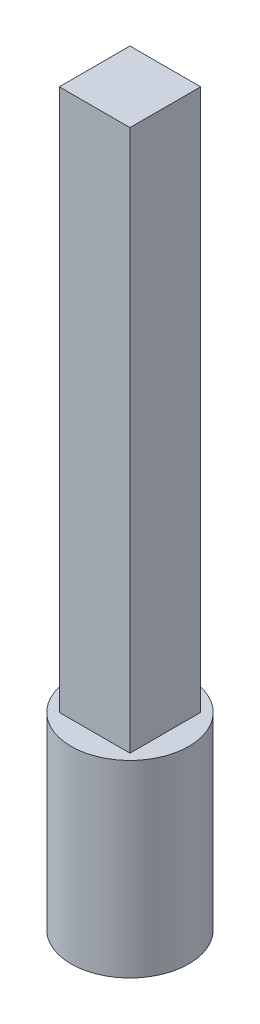
ISO-10303-21;
HEADER;
FILE_DESCRIPTION(('STEP AP214'),'2;1');
FILE_NAME('part.step','',(''),(''),'','','');
FILE_SCHEMA(('AUTOMOTIVE_DESIGN { 1 0 10303 214 1 1 1 1 }'));
ENDSEC;
DATA;
#1=APPLICATION_CONTEXT('core data for automotive mechanical design processes');
#2=APPLICATION_PROTOCOL_DEFINITION('international standard','automotive_design',2000,#1);
#3=PRODUCT_CONTEXT('',#1,'mechanical');
#4=PRODUCT('Part','Part','',(#3));
#5=PRODUCT_RELATED_PRODUCT_CATEGORY('part','',(#4));
#6=PRODUCT_DEFINITION_FORMATION('','',#4);
#7=PRODUCT_DEFINITION_CONTEXT('part definition',#1,'design');
#8=PRODUCT_DEFINITION('design','',#6,#7);
#9=PRODUCT_DEFINITION_SHAPE('','',#8);
#10=(LENGTH_UNIT() NAMED_UNIT(*) SI_UNIT(.MILLI.,.METRE.));
#11=(NAMED_UNIT(*) PLANE_ANGLE_UNIT() SI_UNIT($,.RADIAN.));
#12=(NAMED_UNIT(*) SI_UNIT($,.STERADIAN.) SOLID_ANGLE_UNIT());
#13=UNCERTAINTY_MEASURE_WITH_UNIT(LENGTH_MEASURE(1.E-05),#10,'distance_accuracy_value','');
#14=(GEOMETRIC_REPRESENTATION_CONTEXT(3) GLOBAL_UNCERTAINTY_ASSIGNED_CONTEXT((#13)) GLOBAL_UNIT_ASSIGNED_CONTEXT((#10,
#11,#12)) REPRESENTATION_CONTEXT('',''));
#15=CARTESIAN_POINT('',(0.,0.,0.));
#16=DIRECTION('',(0.,0.,1.));
#17=DIRECTION('',(1.,0.,0.));
#18=AXIS2_PLACEMENT_3D('',#15,#16,#17);
#19=CARTESIAN_POINT('',(0.,80.,0.));
#20=DIRECTION('',(0.,-1.,0.));
#21=DIRECTION('',(0.,0.,-1.));
#22=AXIS2_PLACEMENT_3D('',#19,#20,#21);
#23=CYLINDRICAL_SURFACE('',#22,25.);
#24=CARTESIAN_POINT('',(0.,80.,0.));
#25=DIRECTION('',(0.,1.,0.));
#26=DIRECTION('',(0.,0.,1.));
#27=AXIS2_PLACEMENT_3D('',#24,#25,#26);
#28=CIRCLE('',#27,25.);
#29=CARTESIAN_POINT('',(0.,80.,25.));
#30=VERTEX_POINT('',#29);
#31=EDGE_CURVE('E11',#30,#30,#28,.T.);
#32=ORIENTED_EDGE('',*,*,#31,.F.);
#33=EDGE_LOOP('',(#32));
#34=FACE_BOUND('',#33,.T.);
#35=CARTESIAN_POINT('',(0.,0.,0.));
#36=DIRECTION('',(0.,1.,0.));
#37=DIRECTION('',(0.,0.,1.));
#38=AXIS2_PLACEMENT_3D('',#35,#36,#37);
#39=CIRCLE('',#38,25.);
#40=CARTESIAN_POINT('',(0.,0.,25.));
#41=VERTEX_POINT('',#40);
#42=EDGE_CURVE('E50',#41,#41,#39,.T.);
#43=ORIENTED_EDGE('',*,*,#42,.T.);
#44=EDGE_LOOP('',(#43));
#45=FACE_BOUND('',#44,.T.);
#46=ADVANCED_FACE('F47',(#34,#45),#23,.T.);
#47=CARTESIAN_POINT('',(0.,80.,0.));
#48=DIRECTION('',(0.,1.,0.));
#49=DIRECTION('',(0.,0.,1.));
#50=AXIS2_PLACEMENT_3D('',#47,#48,#49);
#51=PLANE('',#50);
#52=DIRECTION('',(0.,0.,-1.));
#53=VECTOR('',#52,1.);
#54=CARTESIAN_POINT('',(15.,80.,-15.));
#55=LINE('',#54,#53);
#56=CARTESIAN_POINT('',(15.,80.,15.));
#57=VERTEX_POINT('',#56);
#58=CARTESIAN_POINT('',(15.,80.,-15.));
#59=VERTEX_POINT('',#58);
#60=EDGE_CURVE('E62',#57,#59,#55,.T.);
#61=ORIENTED_EDGE('',*,*,#60,.F.);
#62=DIRECTION('',(1.,0.,0.));
#63=VECTOR('',#62,1.);
#64=CARTESIAN_POINT('',(-15.,80.,15.));
#65=LINE('',#64,#63);
#66=CARTESIAN_POINT('',(-15.,80.,15.));
#67=VERTEX_POINT('',#66);
#68=EDGE_CURVE('E66',#67,#57,#65,.T.);
#69=ORIENTED_EDGE('',*,*,#68,.F.);
#70=DIRECTION('',(0.,0.,1.));
#71=VECTOR('',#70,1.);
#72=CARTESIAN_POINT('',(-15.,80.,-15.));
#73=LINE('',#72,#71);
#74=CARTESIAN_POINT('',(-15.,80.,-15.));
#75=VERTEX_POINT('',#74);
#76=EDGE_CURVE('E126',#75,#67,#73,.T.);
#77=ORIENTED_EDGE('',*,*,#76,.F.);
#78=DIRECTION('',(-1.,0.,0.));
#79=VECTOR('',#78,1.);
#80=CARTESIAN_POINT('',(-15.,80.,-15.));
#81=LINE('',#80,#79);
#82=EDGE_CURVE('E129',#59,#75,#81,.T.);
#83=ORIENTED_EDGE('',*,*,#82,.F.);
#84=EDGE_LOOP('',(#61,#69,#77,#83));
#85=FACE_BOUND('',#84,.T.);
#86=ORIENTED_EDGE('',*,*,#31,.T.);
#87=EDGE_LOOP('',(#86));
#88=FACE_BOUND('',#87,.T.);
#89=ADVANCED_FACE('F151',(#85,#88),#51,.T.);
#90=CARTESIAN_POINT('',(0.,0.,0.));
#91=DIRECTION('',(0.,1.,0.));
#92=DIRECTION('',(0.,0.,1.));
#93=AXIS2_PLACEMENT_3D('',#90,#91,#92);
#94=PLANE('',#93);
#95=ORIENTED_EDGE('',*,*,#42,.F.);
#96=EDGE_LOOP('',(#95));
#97=FACE_BOUND('',#96,.T.);
#98=ADVANCED_FACE('F157',(#97),#94,.F.);
#99=CARTESIAN_POINT('',(15.,310.,-15.));
#100=DIRECTION('',(-1.,0.,0.));
#101=DIRECTION('',(0.,0.,1.));
#102=AXIS2_PLACEMENT_3D('',#99,#100,#101);
#103=PLANE('',#102);
#104=ORIENTED_EDGE('',*,*,#60,.T.);
#105=DIRECTION('',(0.,-1.,0.));
#106=VECTOR('',#105,1.);
#107=CARTESIAN_POINT('',(15.,310.,-15.));
#108=LINE('',#107,#106);
#109=CARTESIAN_POINT('',(15.,310.,-15.));
#110=VERTEX_POINT('',#109);
#111=EDGE_CURVE('E91',#110,#59,#108,.T.);
#112=ORIENTED_EDGE('',*,*,#111,.F.);
#113=DIRECTION('',(0.,0.,-1.));
#114=VECTOR('',#113,1.);
#115=CARTESIAN_POINT('',(15.,310.,-15.));
#116=LINE('',#115,#114);
#117=CARTESIAN_POINT('',(15.,310.,15.));
#118=VERTEX_POINT('',#117);
#119=EDGE_CURVE('E98',#118,#110,#116,.T.);
#120=ORIENTED_EDGE('',*,*,#119,.F.);
#121=DIRECTION('',(0.,-1.,0.));
#122=VECTOR('',#121,1.);
#123=CARTESIAN_POINT('',(15.,310.,15.));
#124=LINE('',#123,#122);
#125=EDGE_CURVE('E121',#118,#57,#124,.T.);
#126=ORIENTED_EDGE('',*,*,#125,.T.);
#127=EDGE_LOOP('',(#104,#112,#120,#126));
#128=FACE_BOUND('',#127,.T.);
#129=ADVANCED_FACE('F109',(#128),#103,.F.);
#130=CARTESIAN_POINT('',(-15.,310.,-15.));
#131=DIRECTION('',(0.,0.,1.));
#132=DIRECTION('',(1.,0.,0.));
#133=AXIS2_PLACEMENT_3D('',#130,#131,#132);
#134=PLANE('',#133);
#135=ORIENTED_EDGE('',*,*,#82,.T.);
#136=DIRECTION('',(0.,-1.,0.));
#137=VECTOR('',#136,1.);
#138=CARTESIAN_POINT('',(-15.,310.,-15.));
#139=LINE('',#138,#137);
#140=CARTESIAN_POINT('',(-15.,310.,-15.));
#141=VERTEX_POINT('',#140);
#142=EDGE_CURVE('E93',#141,#75,#139,.T.);
#143=ORIENTED_EDGE('',*,*,#142,.F.);
#144=DIRECTION('',(-1.,0.,0.));
#145=VECTOR('',#144,1.);
#146=CARTESIAN_POINT('',(-15.,310.,-15.));
#147=LINE('',#146,#145);
#148=EDGE_CURVE('E86',#110,#141,#147,.T.);
#149=ORIENTED_EDGE('',*,*,#148,.F.);
#150=ORIENTED_EDGE('',*,*,#111,.T.);
#151=EDGE_LOOP('',(#135,#143,#149,#150));
#152=FACE_BOUND('',#151,.T.);
#153=ADVANCED_FACE('F89',(#152),#134,.F.);
#154=CARTESIAN_POINT('',(-15.,310.,-15.));
#155=DIRECTION('',(1.,0.,0.));
#156=DIRECTION('',(0.,0.,-1.));
#157=AXIS2_PLACEMENT_3D('',#154,#155,#156);
#158=PLANE('',#157);
#159=ORIENTED_EDGE('',*,*,#76,.T.);
#160=DIRECTION('',(0.,-1.,0.));
#161=VECTOR('',#160,1.);
#162=CARTESIAN_POINT('',(-15.,310.,15.));
#163=LINE('',#162,#161);
#164=CARTESIAN_POINT('',(-15.,310.,15.));
#165=VERTEX_POINT('',#164);
#166=EDGE_CURVE('E115',#165,#67,#163,.T.);
#167=ORIENTED_EDGE('',*,*,#166,.F.);
#168=DIRECTION('',(0.,0.,1.));
#169=VECTOR('',#168,1.);
#170=CARTESIAN_POINT('',(-15.,310.,-15.));
#171=LINE('',#170,#169);
#172=EDGE_CURVE('E97',#141,#165,#171,.T.);
#173=ORIENTED_EDGE('',*,*,#172,.F.);
#174=ORIENTED_EDGE('',*,*,#142,.T.);
#175=EDGE_LOOP('',(#159,#167,#173,#174));
#176=FACE_BOUND('',#175,.T.);
#177=ADVANCED_FACE('F139',(#176),#158,.F.);
#178=CARTESIAN_POINT('',(-15.,310.,15.));
#179=DIRECTION('',(0.,0.,-1.));
#180=DIRECTION('',(-1.,0.,0.));
#181=AXIS2_PLACEMENT_3D('',#178,#179,#180);
#182=PLANE('',#181);
#183=ORIENTED_EDGE('',*,*,#68,.T.);
#184=ORIENTED_EDGE('',*,*,#125,.F.);
#185=DIRECTION('',(1.,0.,0.));
#186=VECTOR('',#185,1.);
#187=CARTESIAN_POINT('',(-15.,310.,15.));
#188=LINE('',#187,#186);
#189=EDGE_CURVE('E103',#165,#118,#188,.T.);
#190=ORIENTED_EDGE('',*,*,#189,.F.);
#191=ORIENTED_EDGE('',*,*,#166,.T.);
#192=EDGE_LOOP('',(#183,#184,#190,#191));
#193=FACE_BOUND('',#192,.T.);
#194=ADVANCED_FACE('F141',(#193),#182,.F.);
#195=CARTESIAN_POINT('',(0.,310.,0.));
#196=DIRECTION('',(0.,1.,0.));
#197=DIRECTION('',(0.,0.,1.));
#198=AXIS2_PLACEMENT_3D('',#195,#196,#197);
#199=PLANE('',#198);
#200=ORIENTED_EDGE('',*,*,#119,.T.);
#201=ORIENTED_EDGE('',*,*,#148,.T.);
#202=ORIENTED_EDGE('',*,*,#172,.T.);
#203=ORIENTED_EDGE('',*,*,#189,.T.);
#204=EDGE_LOOP('',(#200,#201,#202,#203));
#205=FACE_BOUND('',#204,.T.);
#206=ADVANCED_FACE('F101',(#205),#199,.T.);
#207=CLOSED_SHELL('',(#46,#89,#98,#129,#153,#177,#194,#206));
#208=MANIFOLD_SOLID_BREP('B2',#207);
#209=ADVANCED_BREP_SHAPE_REPRESENTATION('',(#18,#208),#14);
#210=SHAPE_DEFINITION_REPRESENTATION(#9,#209);
ENDSEC;
END-ISO-10303-21;
